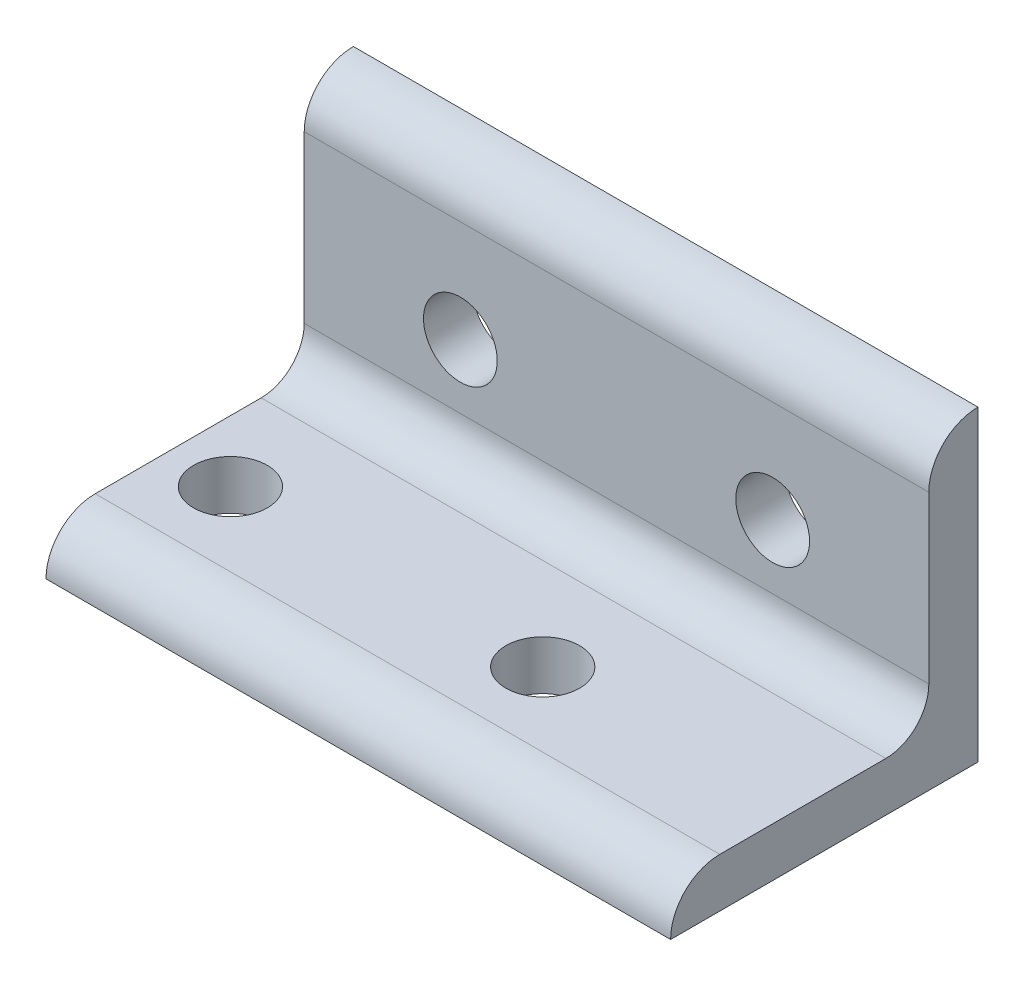
ISO-10303-21;
HEADER;
FILE_DESCRIPTION(('STEP AP214'),'2;1');
FILE_NAME('part.step','',(''),(''),'','','');
FILE_SCHEMA(('AUTOMOTIVE_DESIGN { 1 0 10303 214 1 1 1 1 }'));
ENDSEC;
DATA;
#1=APPLICATION_CONTEXT('core data for automotive mechanical design processes');
#2=APPLICATION_PROTOCOL_DEFINITION('international standard','automotive_design',2000,#1);
#3=PRODUCT_CONTEXT('',#1,'mechanical');
#4=PRODUCT('Part','Part','',(#3));
#5=PRODUCT_RELATED_PRODUCT_CATEGORY('part','',(#4));
#6=PRODUCT_DEFINITION_FORMATION('','',#4);
#7=PRODUCT_DEFINITION_CONTEXT('part definition',#1,'design');
#8=PRODUCT_DEFINITION('design','',#6,#7);
#9=PRODUCT_DEFINITION_SHAPE('','',#8);
#10=(LENGTH_UNIT() NAMED_UNIT(*) SI_UNIT(.MILLI.,.METRE.));
#11=(NAMED_UNIT(*) PLANE_ANGLE_UNIT() SI_UNIT($,.RADIAN.));
#12=(NAMED_UNIT(*) SI_UNIT($,.STERADIAN.) SOLID_ANGLE_UNIT());
#13=UNCERTAINTY_MEASURE_WITH_UNIT(LENGTH_MEASURE(1.E-05),#10,'distance_accuracy_value','');
#14=(GEOMETRIC_REPRESENTATION_CONTEXT(3) GLOBAL_UNCERTAINTY_ASSIGNED_CONTEXT((#13)) GLOBAL_UNIT_ASSIGNED_CONTEXT((#10,
#11,#12)) REPRESENTATION_CONTEXT('',''));
#15=CARTESIAN_POINT('',(0.,0.,0.));
#16=DIRECTION('',(0.,0.,1.));
#17=DIRECTION('',(1.,0.,0.));
#18=AXIS2_PLACEMENT_3D('',#15,#16,#17);
#19=CARTESIAN_POINT('',(20.2033377151072,25.,0.));
#20=DIRECTION('',(0.,0.,1.));
#21=DIRECTION('',(1.,0.,0.));
#22=AXIS2_PLACEMENT_3D('',#19,#20,#21);
#23=PLANE('',#22);
#24=CARTESIAN_POINT('',(7.50333771510723,12.7,0.));
#25=DIRECTION('',(0.,0.,1.));
#26=DIRECTION('',(1.,0.,0.));
#27=AXIS2_PLACEMENT_3D('',#24,#25,#26);
#28=CIRCLE('',#27,3.);
#29=CARTESIAN_POINT('',(10.5033377151072,12.7,0.));
#30=VERTEX_POINT('',#29);
#31=EDGE_CURVE('E186',#30,#30,#28,.T.);
#32=ORIENTED_EDGE('',*,*,#31,.T.);
#33=EDGE_LOOP('',(#32));
#34=FACE_BOUND('',#33,.T.);
#35=CARTESIAN_POINT('',(-17.8966622848928,12.7,0.));
#36=DIRECTION('',(0.,0.,1.));
#37=DIRECTION('',(1.,0.,0.));
#38=AXIS2_PLACEMENT_3D('',#35,#36,#37);
#39=CIRCLE('',#38,3.);
#40=CARTESIAN_POINT('',(-14.8966622848928,12.7,0.));
#41=VERTEX_POINT('',#40);
#42=EDGE_CURVE('E151',#41,#41,#39,.T.);
#43=ORIENTED_EDGE('',*,*,#42,.T.);
#44=EDGE_LOOP('',(#43));
#45=FACE_BOUND('',#44,.T.);
#46=DIRECTION('',(0.,1.,0.));
#47=VECTOR('',#46,1.);
#48=CARTESIAN_POINT('',(-30.5966622848928,25.,0.));
#49=LINE('',#48,#47);
#50=CARTESIAN_POINT('',(-30.5966622848928,0.,0.));
#51=VERTEX_POINT('',#50);
#52=CARTESIAN_POINT('',(-30.5966622848928,25.,0.));
#53=VERTEX_POINT('',#52);
#54=EDGE_CURVE('E147',#51,#53,#49,.T.);
#55=ORIENTED_EDGE('',*,*,#54,.T.);
#56=DIRECTION('',(-1.,0.,0.));
#57=VECTOR('',#56,1.);
#58=CARTESIAN_POINT('',(20.2033377151072,25.,0.));
#59=LINE('',#58,#57);
#60=CARTESIAN_POINT('',(20.2033377151072,25.,0.));
#61=VERTEX_POINT('',#60);
#62=EDGE_CURVE('E12',#61,#53,#59,.T.);
#63=ORIENTED_EDGE('',*,*,#62,.F.);
#64=DIRECTION('',(0.,1.,0.));
#65=VECTOR('',#64,1.);
#66=CARTESIAN_POINT('',(20.2033377151072,25.,0.));
#67=LINE('',#66,#65);
#68=CARTESIAN_POINT('',(20.2033377151072,0.,0.));
#69=VERTEX_POINT('',#68);
#70=EDGE_CURVE('E160',#69,#61,#67,.T.);
#71=ORIENTED_EDGE('',*,*,#70,.F.);
#72=DIRECTION('',(-1.,0.,0.));
#73=VECTOR('',#72,1.);
#74=CARTESIAN_POINT('',(20.2033377151072,0.,0.));
#75=LINE('',#74,#73);
#76=EDGE_CURVE('E143',#69,#51,#75,.T.);
#77=ORIENTED_EDGE('',*,*,#76,.T.);
#78=EDGE_LOOP('',(#55,#63,#71,#77));
#79=FACE_BOUND('',#78,.T.);
#80=ADVANCED_FACE('F57',(#34,#45,#79),#23,.F.);
#81=CARTESIAN_POINT('',(20.2033377151072,21.,0.));
#82=DIRECTION('',(-1.,0.,0.));
#83=DIRECTION('',(0.,0.,1.));
#84=AXIS2_PLACEMENT_3D('',#81,#82,#83);
#85=CYLINDRICAL_SURFACE('',#84,4.);
#86=CARTESIAN_POINT('',(-30.5966622848928,21.,0.));
#87=DIRECTION('',(1.,0.,0.));
#88=DIRECTION('',(0.,0.,-1.));
#89=AXIS2_PLACEMENT_3D('',#86,#87,#88);
#90=CIRCLE('',#89,4.);
#91=CARTESIAN_POINT('',(-30.5966622848928,21.,4.));
#92=VERTEX_POINT('',#91);
#93=EDGE_CURVE('E150',#53,#92,#90,.T.);
#94=ORIENTED_EDGE('',*,*,#93,.T.);
#95=DIRECTION('',(-1.,0.,0.));
#96=VECTOR('',#95,1.);
#97=CARTESIAN_POINT('',(20.2033377151072,21.,4.));
#98=LINE('',#97,#96);
#99=CARTESIAN_POINT('',(20.2033377151072,21.,4.));
#100=VERTEX_POINT('',#99);
#101=EDGE_CURVE('E65',#100,#92,#98,.T.);
#102=ORIENTED_EDGE('',*,*,#101,.F.);
#103=CARTESIAN_POINT('',(20.2033377151072,21.,0.));
#104=DIRECTION('',(1.,0.,0.));
#105=DIRECTION('',(0.,0.,-1.));
#106=AXIS2_PLACEMENT_3D('',#103,#104,#105);
#107=CIRCLE('',#106,4.);
#108=EDGE_CURVE('E113',#61,#100,#107,.T.);
#109=ORIENTED_EDGE('',*,*,#108,.F.);
#110=ORIENTED_EDGE('',*,*,#62,.T.);
#111=EDGE_LOOP('',(#94,#102,#109,#110));
#112=FACE_BOUND('',#111,.T.);
#113=ADVANCED_FACE('F234',(#112),#85,.T.);
#114=CARTESIAN_POINT('',(20.2033377151072,7.5,4.));
#115=DIRECTION('',(0.,0.,-1.));
#116=DIRECTION('',(0.,1.,0.));
#117=AXIS2_PLACEMENT_3D('',#114,#115,#116);
#118=PLANE('',#117);
#119=CARTESIAN_POINT('',(7.50333771510723,12.7,4.));
#120=DIRECTION('',(0.,0.,1.));
#121=DIRECTION('',(1.,0.,0.));
#122=AXIS2_PLACEMENT_3D('',#119,#120,#121);
#123=CIRCLE('',#122,3.);
#124=CARTESIAN_POINT('',(10.5033377151072,12.7,4.));
#125=VERTEX_POINT('',#124);
#126=EDGE_CURVE('E189',#125,#125,#123,.T.);
#127=ORIENTED_EDGE('',*,*,#126,.F.);
#128=EDGE_LOOP('',(#127));
#129=FACE_BOUND('',#128,.T.);
#130=CARTESIAN_POINT('',(-17.8966622848928,12.7,4.));
#131=DIRECTION('',(0.,0.,1.));
#132=DIRECTION('',(1.,0.,0.));
#133=AXIS2_PLACEMENT_3D('',#130,#131,#132);
#134=CIRCLE('',#133,3.);
#135=CARTESIAN_POINT('',(-14.8966622848928,12.7,4.));
#136=VERTEX_POINT('',#135);
#137=EDGE_CURVE('E183',#136,#136,#134,.T.);
#138=ORIENTED_EDGE('',*,*,#137,.F.);
#139=EDGE_LOOP('',(#138));
#140=FACE_BOUND('',#139,.T.);
#141=DIRECTION('',(0.,-1.,0.));
#142=VECTOR('',#141,1.);
#143=CARTESIAN_POINT('',(-30.5966622848928,7.5,4.));
#144=LINE('',#143,#142);
#145=CARTESIAN_POINT('',(-30.5966622848928,7.5,4.));
#146=VERTEX_POINT('',#145);
#147=EDGE_CURVE('E153',#92,#146,#144,.T.);
#148=ORIENTED_EDGE('',*,*,#147,.T.);
#149=DIRECTION('',(-1.,0.,0.));
#150=VECTOR('',#149,1.);
#151=CARTESIAN_POINT('',(20.2033377151072,7.5,4.));
#152=LINE('',#151,#150);
#153=CARTESIAN_POINT('',(20.2033377151072,7.5,4.));
#154=VERTEX_POINT('',#153);
#155=EDGE_CURVE('E164',#154,#146,#152,.T.);
#156=ORIENTED_EDGE('',*,*,#155,.F.);
#157=DIRECTION('',(0.,-1.,0.));
#158=VECTOR('',#157,1.);
#159=CARTESIAN_POINT('',(20.2033377151072,7.5,4.));
#160=LINE('',#159,#158);
#161=EDGE_CURVE('E172',#100,#154,#160,.T.);
#162=ORIENTED_EDGE('',*,*,#161,.F.);
#163=ORIENTED_EDGE('',*,*,#101,.T.);
#164=EDGE_LOOP('',(#148,#156,#162,#163));
#165=FACE_BOUND('',#164,.T.);
#166=ADVANCED_FACE('F170',(#129,#140,#165),#118,.F.);
#167=CARTESIAN_POINT('',(20.2033377151072,7.5,7.5));
#168=DIRECTION('',(-1.,0.,0.));
#169=DIRECTION('',(0.,0.,1.));
#170=AXIS2_PLACEMENT_3D('',#167,#168,#169);
#171=CYLINDRICAL_SURFACE('',#170,3.5);
#172=CARTESIAN_POINT('',(-30.5966622848928,7.5,7.5));
#173=DIRECTION('',(-1.,0.,0.));
#174=DIRECTION('',(0.,0.,1.));
#175=AXIS2_PLACEMENT_3D('',#172,#173,#174);
#176=CIRCLE('',#175,3.5);
#177=CARTESIAN_POINT('',(-30.5966622848928,4.,7.5));
#178=VERTEX_POINT('',#177);
#179=EDGE_CURVE('E155',#146,#178,#176,.T.);
#180=ORIENTED_EDGE('',*,*,#179,.T.);
#181=DIRECTION('',(-1.,0.,0.));
#182=VECTOR('',#181,1.);
#183=CARTESIAN_POINT('',(20.2033377151072,4.,7.5));
#184=LINE('',#183,#182);
#185=CARTESIAN_POINT('',(20.2033377151072,4.,7.5));
#186=VERTEX_POINT('',#185);
#187=EDGE_CURVE('E138',#186,#178,#184,.T.);
#188=ORIENTED_EDGE('',*,*,#187,.F.);
#189=CARTESIAN_POINT('',(20.2033377151072,7.5,7.5));
#190=DIRECTION('',(-1.,0.,0.));
#191=DIRECTION('',(0.,0.,1.));
#192=AXIS2_PLACEMENT_3D('',#189,#190,#191);
#193=CIRCLE('',#192,3.5);
#194=EDGE_CURVE('E129',#154,#186,#193,.T.);
#195=ORIENTED_EDGE('',*,*,#194,.F.);
#196=ORIENTED_EDGE('',*,*,#155,.T.);
#197=EDGE_LOOP('',(#180,#188,#195,#196));
#198=FACE_BOUND('',#197,.T.);
#199=ADVANCED_FACE('F178',(#198),#171,.F.);
#200=CARTESIAN_POINT('',(20.2033377151072,4.,21.));
#201=DIRECTION('',(0.,-1.,0.));
#202=DIRECTION('',(0.,0.,-1.));
#203=AXIS2_PLACEMENT_3D('',#200,#201,#202);
#204=PLANE('',#203);
#205=CARTESIAN_POINT('',(-0.196662284892773,4.,15.));
#206=DIRECTION('',(0.,1.,0.));
#207=DIRECTION('',(0.,0.,1.));
#208=AXIS2_PLACEMENT_3D('',#205,#206,#207);
#209=CIRCLE('',#208,3.);
#210=CARTESIAN_POINT('',(-0.196662284892773,4.,18.));
#211=VERTEX_POINT('',#210);
#212=EDGE_CURVE('E201',#211,#211,#209,.T.);
#213=ORIENTED_EDGE('',*,*,#212,.F.);
#214=EDGE_LOOP('',(#213));
#215=FACE_BOUND('',#214,.T.);
#216=CARTESIAN_POINT('',(-25.5966622848928,4.,15.));
#217=DIRECTION('',(0.,1.,0.));
#218=DIRECTION('',(0.,0.,1.));
#219=AXIS2_PLACEMENT_3D('',#216,#217,#218);
#220=CIRCLE('',#219,2.99999999999999);
#221=CARTESIAN_POINT('',(-25.5966622848928,4.,18.));
#222=VERTEX_POINT('',#221);
#223=EDGE_CURVE('E195',#222,#222,#220,.T.);
#224=ORIENTED_EDGE('',*,*,#223,.F.);
#225=EDGE_LOOP('',(#224));
#226=FACE_BOUND('',#225,.T.);
#227=DIRECTION('',(0.,0.,1.));
#228=VECTOR('',#227,1.);
#229=CARTESIAN_POINT('',(-30.5966622848928,4.,21.));
#230=LINE('',#229,#228);
#231=CARTESIAN_POINT('',(-30.5966622848928,4.,21.));
#232=VERTEX_POINT('',#231);
#233=EDGE_CURVE('E137',#178,#232,#230,.T.);
#234=ORIENTED_EDGE('',*,*,#233,.T.);
#235=DIRECTION('',(-1.,0.,0.));
#236=VECTOR('',#235,1.);
#237=CARTESIAN_POINT('',(20.2033377151072,4.,21.));
#238=LINE('',#237,#236);
#239=CARTESIAN_POINT('',(20.2033377151072,4.,21.));
#240=VERTEX_POINT('',#239);
#241=EDGE_CURVE('E134',#240,#232,#238,.T.);
#242=ORIENTED_EDGE('',*,*,#241,.F.);
#243=DIRECTION('',(0.,0.,1.));
#244=VECTOR('',#243,1.);
#245=CARTESIAN_POINT('',(20.2033377151072,4.,21.));
#246=LINE('',#245,#244);
#247=EDGE_CURVE('E123',#186,#240,#246,.T.);
#248=ORIENTED_EDGE('',*,*,#247,.F.);
#249=ORIENTED_EDGE('',*,*,#187,.T.);
#250=EDGE_LOOP('',(#234,#242,#248,#249));
#251=FACE_BOUND('',#250,.T.);
#252=ADVANCED_FACE('F135',(#215,#226,#251),#204,.F.);
#253=CARTESIAN_POINT('',(20.2033377151072,0.,21.));
#254=DIRECTION('',(-1.,0.,0.));
#255=DIRECTION('',(0.,0.,1.));
#256=AXIS2_PLACEMENT_3D('',#253,#254,#255);
#257=CYLINDRICAL_SURFACE('',#256,4.);
#258=CARTESIAN_POINT('',(-30.5966622848928,0.,21.));
#259=DIRECTION('',(1.,0.,0.));
#260=DIRECTION('',(0.,0.,1.));
#261=AXIS2_PLACEMENT_3D('',#258,#259,#260);
#262=CIRCLE('',#261,4.);
#263=CARTESIAN_POINT('',(-30.5966622848928,0.,25.));
#264=VERTEX_POINT('',#263);
#265=EDGE_CURVE('E99',#232,#264,#262,.T.);
#266=ORIENTED_EDGE('',*,*,#265,.T.);
#267=DIRECTION('',(-1.,0.,0.));
#268=VECTOR('',#267,1.);
#269=CARTESIAN_POINT('',(20.2033377151072,0.,25.));
#270=LINE('',#269,#268);
#271=CARTESIAN_POINT('',(20.2033377151072,0.,25.));
#272=VERTEX_POINT('',#271);
#273=EDGE_CURVE('E139',#272,#264,#270,.T.);
#274=ORIENTED_EDGE('',*,*,#273,.F.);
#275=CARTESIAN_POINT('',(20.2033377151072,0.,21.));
#276=DIRECTION('',(1.,0.,0.));
#277=DIRECTION('',(0.,0.,1.));
#278=AXIS2_PLACEMENT_3D('',#275,#276,#277);
#279=CIRCLE('',#278,4.);
#280=EDGE_CURVE('E127',#240,#272,#279,.T.);
#281=ORIENTED_EDGE('',*,*,#280,.F.);
#282=ORIENTED_EDGE('',*,*,#241,.T.);
#283=EDGE_LOOP('',(#266,#274,#281,#282));
#284=FACE_BOUND('',#283,.T.);
#285=ADVANCED_FACE('F141',(#284),#257,.T.);
#286=CARTESIAN_POINT('',(20.2033377151072,0.,0.));
#287=DIRECTION('',(0.,1.,0.));
#288=DIRECTION('',(0.,0.,1.));
#289=AXIS2_PLACEMENT_3D('',#286,#287,#288);
#290=PLANE('',#289);
#291=CARTESIAN_POINT('',(-0.196662284892773,0.,15.));
#292=DIRECTION('',(0.,1.,0.));
#293=DIRECTION('',(0.,0.,1.));
#294=AXIS2_PLACEMENT_3D('',#291,#292,#293);
#295=CIRCLE('',#294,3.);
#296=CARTESIAN_POINT('',(-0.196662284892773,0.,18.));
#297=VERTEX_POINT('',#296);
#298=EDGE_CURVE('E198',#297,#297,#295,.T.);
#299=ORIENTED_EDGE('',*,*,#298,.T.);
#300=EDGE_LOOP('',(#299));
#301=FACE_BOUND('',#300,.T.);
#302=CARTESIAN_POINT('',(-25.5966622848928,0.,15.));
#303=DIRECTION('',(0.,1.,0.));
#304=DIRECTION('',(0.,0.,1.));
#305=AXIS2_PLACEMENT_3D('',#302,#303,#304);
#306=CIRCLE('',#305,2.99999999999999);
#307=CARTESIAN_POINT('',(-25.5966622848928,0.,18.));
#308=VERTEX_POINT('',#307);
#309=EDGE_CURVE('E192',#308,#308,#306,.T.);
#310=ORIENTED_EDGE('',*,*,#309,.T.);
#311=EDGE_LOOP('',(#310));
#312=FACE_BOUND('',#311,.T.);
#313=DIRECTION('',(0.,0.,-1.));
#314=VECTOR('',#313,1.);
#315=CARTESIAN_POINT('',(-30.5966622848928,0.,0.));
#316=LINE('',#315,#314);
#317=EDGE_CURVE('E105',#264,#51,#316,.T.);
#318=ORIENTED_EDGE('',*,*,#317,.T.);
#319=ORIENTED_EDGE('',*,*,#76,.F.);
#320=DIRECTION('',(0.,0.,-1.));
#321=VECTOR('',#320,1.);
#322=CARTESIAN_POINT('',(20.2033377151072,0.,0.));
#323=LINE('',#322,#321);
#324=EDGE_CURVE('E73',#272,#69,#323,.T.);
#325=ORIENTED_EDGE('',*,*,#324,.F.);
#326=ORIENTED_EDGE('',*,*,#273,.T.);
#327=EDGE_LOOP('',(#318,#319,#325,#326));
#328=FACE_BOUND('',#327,.T.);
#329=ADVANCED_FACE('F207',(#301,#312,#328),#290,.F.);
#330=CARTESIAN_POINT('',(20.2033377151072,0.,21.));
#331=DIRECTION('',(-1.,0.,0.));
#332=DIRECTION('',(0.,0.,1.));
#333=AXIS2_PLACEMENT_3D('',#330,#331,#332);
#334=PLANE('',#333);
#335=ORIENTED_EDGE('',*,*,#70,.T.);
#336=ORIENTED_EDGE('',*,*,#108,.T.);
#337=ORIENTED_EDGE('',*,*,#161,.T.);
#338=ORIENTED_EDGE('',*,*,#194,.T.);
#339=ORIENTED_EDGE('',*,*,#247,.T.);
#340=ORIENTED_EDGE('',*,*,#280,.T.);
#341=ORIENTED_EDGE('',*,*,#324,.T.);
#342=EDGE_LOOP('',(#335,#336,#337,#338,#339,#340,#341));
#343=FACE_BOUND('',#342,.T.);
#344=ADVANCED_FACE('F125',(#343),#334,.F.);
#345=CARTESIAN_POINT('',(-30.5966622848928,0.,21.));
#346=DIRECTION('',(-1.,0.,0.));
#347=DIRECTION('',(0.,0.,1.));
#348=AXIS2_PLACEMENT_3D('',#345,#346,#347);
#349=PLANE('',#348);
#350=ORIENTED_EDGE('',*,*,#54,.F.);
#351=ORIENTED_EDGE('',*,*,#317,.F.);
#352=ORIENTED_EDGE('',*,*,#265,.F.);
#353=ORIENTED_EDGE('',*,*,#233,.F.);
#354=ORIENTED_EDGE('',*,*,#179,.F.);
#355=ORIENTED_EDGE('',*,*,#147,.F.);
#356=ORIENTED_EDGE('',*,*,#93,.F.);
#357=EDGE_LOOP('',(#350,#351,#352,#353,#354,#355,#356));
#358=FACE_BOUND('',#357,.T.);
#359=ADVANCED_FACE('F176',(#358),#349,.T.);
#360=CARTESIAN_POINT('',(-17.8966622848928,12.7,0.));
#361=DIRECTION('',(0.,0.,1.));
#362=DIRECTION('',(1.,0.,0.));
#363=AXIS2_PLACEMENT_3D('',#360,#361,#362);
#364=CYLINDRICAL_SURFACE('',#363,3.);
#365=ORIENTED_EDGE('',*,*,#42,.F.);
#366=EDGE_LOOP('',(#365));
#367=FACE_BOUND('',#366,.T.);
#368=ORIENTED_EDGE('',*,*,#137,.T.);
#369=EDGE_LOOP('',(#368));
#370=FACE_BOUND('',#369,.T.);
#371=ADVANCED_FACE('F229',(#367,#370),#364,.F.);
#372=CARTESIAN_POINT('',(7.50333771510723,12.7,0.));
#373=DIRECTION('',(0.,0.,1.));
#374=DIRECTION('',(1.,0.,0.));
#375=AXIS2_PLACEMENT_3D('',#372,#373,#374);
#376=CYLINDRICAL_SURFACE('',#375,3.);
#377=ORIENTED_EDGE('',*,*,#31,.F.);
#378=EDGE_LOOP('',(#377));
#379=FACE_BOUND('',#378,.T.);
#380=ORIENTED_EDGE('',*,*,#126,.T.);
#381=EDGE_LOOP('',(#380));
#382=FACE_BOUND('',#381,.T.);
#383=ADVANCED_FACE('F223',(#379,#382),#376,.F.);
#384=CARTESIAN_POINT('',(-25.5966622848928,0.,15.));
#385=DIRECTION('',(0.,1.,0.));
#386=DIRECTION('',(0.,0.,1.));
#387=AXIS2_PLACEMENT_3D('',#384,#385,#386);
#388=CYLINDRICAL_SURFACE('',#387,2.99999999999999);
#389=ORIENTED_EDGE('',*,*,#309,.F.);
#390=EDGE_LOOP('',(#389));
#391=FACE_BOUND('',#390,.T.);
#392=ORIENTED_EDGE('',*,*,#223,.T.);
#393=EDGE_LOOP('',(#392));
#394=FACE_BOUND('',#393,.T.);
#395=ADVANCED_FACE('F213',(#391,#394),#388,.F.);
#396=CARTESIAN_POINT('',(-0.196662284892773,0.,15.));
#397=DIRECTION('',(0.,1.,0.));
#398=DIRECTION('',(0.,0.,1.));
#399=AXIS2_PLACEMENT_3D('',#396,#397,#398);
#400=CYLINDRICAL_SURFACE('',#399,3.);
#401=ORIENTED_EDGE('',*,*,#298,.F.);
#402=EDGE_LOOP('',(#401));
#403=FACE_BOUND('',#402,.T.);
#404=ORIENTED_EDGE('',*,*,#212,.T.);
#405=EDGE_LOOP('',(#404));
#406=FACE_BOUND('',#405,.T.);
#407=ADVANCED_FACE('F210',(#403,#406),#400,.F.);
#408=CLOSED_SHELL('',(#80,#113,#166,#199,#252,#285,#329,#344,#359,#371,#383,#395,#407));
#409=MANIFOLD_SOLID_BREP('B2',#408);
#410=ADVANCED_BREP_SHAPE_REPRESENTATION('',(#18,#409),#14);
#411=SHAPE_DEFINITION_REPRESENTATION(#9,#410);
ENDSEC;
END-ISO-10303-21;
